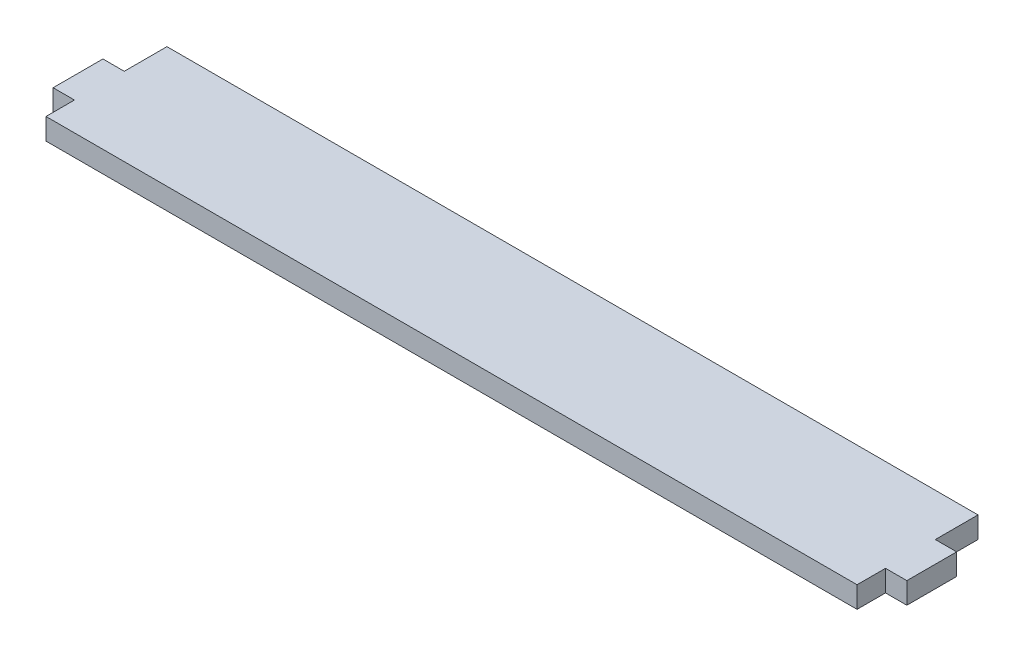
ISO-10303-21;
HEADER;
FILE_DESCRIPTION(('STEP AP214'),'2;1');
FILE_NAME('part.step','',(''),(''),'','','');
FILE_SCHEMA(('AUTOMOTIVE_DESIGN { 1 0 10303 214 1 1 1 1 }'));
ENDSEC;
DATA;
#1=APPLICATION_CONTEXT('core data for automotive mechanical design processes');
#2=APPLICATION_PROTOCOL_DEFINITION('international standard','automotive_design',2000,#1);
#3=PRODUCT_CONTEXT('',#1,'mechanical');
#4=PRODUCT('Part','Part','',(#3));
#5=PRODUCT_RELATED_PRODUCT_CATEGORY('part','',(#4));
#6=PRODUCT_DEFINITION_FORMATION('','',#4);
#7=PRODUCT_DEFINITION_CONTEXT('part definition',#1,'design');
#8=PRODUCT_DEFINITION('design','',#6,#7);
#9=PRODUCT_DEFINITION_SHAPE('','',#8);
#10=(LENGTH_UNIT() NAMED_UNIT(*) SI_UNIT(.MILLI.,.METRE.));
#11=(NAMED_UNIT(*) PLANE_ANGLE_UNIT() SI_UNIT($,.RADIAN.));
#12=(NAMED_UNIT(*) SI_UNIT($,.STERADIAN.) SOLID_ANGLE_UNIT());
#13=UNCERTAINTY_MEASURE_WITH_UNIT(LENGTH_MEASURE(1.E-05),#10,'distance_accuracy_value','');
#14=(GEOMETRIC_REPRESENTATION_CONTEXT(3) GLOBAL_UNCERTAINTY_ASSIGNED_CONTEXT((#13)) GLOBAL_UNIT_ASSIGNED_CONTEXT((#10,
#11,#12)) REPRESENTATION_CONTEXT('',''));
#15=CARTESIAN_POINT('',(0.,0.,0.));
#16=DIRECTION('',(0.,0.,1.));
#17=DIRECTION('',(1.,0.,0.));
#18=AXIS2_PLACEMENT_3D('',#15,#16,#17);
#19=CARTESIAN_POINT('',(-57.,3.,-2.5));
#20=DIRECTION('',(1.,0.,0.));
#21=DIRECTION('',(0.,0.,-1.));
#22=AXIS2_PLACEMENT_3D('',#19,#20,#21);
#23=PLANE('',#22);
#24=DIRECTION('',(0.,0.,1.));
#25=VECTOR('',#24,1.);
#26=CARTESIAN_POINT('',(-57.,0.,-2.5));
#27=LINE('',#26,#25);
#28=CARTESIAN_POINT('',(-57.,0.,-8.49999999999999));
#29=VERTEX_POINT('',#28);
#30=CARTESIAN_POINT('',(-57.,0.,-2.5));
#31=VERTEX_POINT('',#30);
#32=EDGE_CURVE('E155',#29,#31,#27,.T.);
#33=ORIENTED_EDGE('',*,*,#32,.T.);
#34=DIRECTION('',(0.,-1.,0.));
#35=VECTOR('',#34,1.);
#36=CARTESIAN_POINT('',(-57.,3.,-2.5));
#37=LINE('',#36,#35);
#38=CARTESIAN_POINT('',(-57.,3.,-2.5));
#39=VERTEX_POINT('',#38);
#40=EDGE_CURVE('E11',#39,#31,#37,.T.);
#41=ORIENTED_EDGE('',*,*,#40,.F.);
#42=DIRECTION('',(0.,0.,1.));
#43=VECTOR('',#42,1.);
#44=CARTESIAN_POINT('',(-57.,3.,-2.5));
#45=LINE('',#44,#43);
#46=CARTESIAN_POINT('',(-57.,3.,-8.49999999999999));
#47=VERTEX_POINT('',#46);
#48=EDGE_CURVE('E177',#47,#39,#45,.T.);
#49=ORIENTED_EDGE('',*,*,#48,.F.);
#50=DIRECTION('',(0.,-1.,0.));
#51=VECTOR('',#50,1.);
#52=CARTESIAN_POINT('',(-57.,3.,-8.49999999999999));
#53=LINE('',#52,#51);
#54=EDGE_CURVE('E151',#47,#29,#53,.T.);
#55=ORIENTED_EDGE('',*,*,#54,.T.);
#56=EDGE_LOOP('',(#33,#41,#49,#55));
#57=FACE_BOUND('',#56,.T.);
#58=ADVANCED_FACE('F35',(#57),#23,.F.);
#59=CARTESIAN_POINT('',(-57.,3.,-2.5));
#60=DIRECTION('',(0.,0.,1.));
#61=DIRECTION('',(1.,0.,0.));
#62=AXIS2_PLACEMENT_3D('',#59,#60,#61);
#63=PLANE('',#62);
#64=DIRECTION('',(-1.,0.,0.));
#65=VECTOR('',#64,1.);
#66=CARTESIAN_POINT('',(-57.,0.,-2.5));
#67=LINE('',#66,#65);
#68=CARTESIAN_POINT('',(-60.,0.,-2.5));
#69=VERTEX_POINT('',#68);
#70=EDGE_CURVE('E158',#31,#69,#67,.T.);
#71=ORIENTED_EDGE('',*,*,#70,.T.);
#72=DIRECTION('',(0.,-1.,0.));
#73=VECTOR('',#72,1.);
#74=CARTESIAN_POINT('',(-60.,3.,-2.5));
#75=LINE('',#74,#73);
#76=CARTESIAN_POINT('',(-60.,3.,-2.5));
#77=VERTEX_POINT('',#76);
#78=EDGE_CURVE('E43',#77,#69,#75,.T.);
#79=ORIENTED_EDGE('',*,*,#78,.F.);
#80=DIRECTION('',(-1.,0.,0.));
#81=VECTOR('',#80,1.);
#82=CARTESIAN_POINT('',(-57.,3.,-2.5));
#83=LINE('',#82,#81);
#84=EDGE_CURVE('E106',#39,#77,#83,.T.);
#85=ORIENTED_EDGE('',*,*,#84,.F.);
#86=ORIENTED_EDGE('',*,*,#40,.T.);
#87=EDGE_LOOP('',(#71,#79,#85,#86));
#88=FACE_BOUND('',#87,.T.);
#89=ADVANCED_FACE('F255',(#88),#63,.F.);
#90=CARTESIAN_POINT('',(-60.,3.,-2.5));
#91=DIRECTION('',(1.,0.,0.));
#92=DIRECTION('',(0.,0.,-1.));
#93=AXIS2_PLACEMENT_3D('',#90,#91,#92);
#94=PLANE('',#93);
#95=DIRECTION('',(0.,0.,1.));
#96=VECTOR('',#95,1.);
#97=CARTESIAN_POINT('',(-60.,0.,-2.5));
#98=LINE('',#97,#96);
#99=CARTESIAN_POINT('',(-60.,0.,4.5));
#100=VERTEX_POINT('',#99);
#101=EDGE_CURVE('E160',#69,#100,#98,.T.);
#102=ORIENTED_EDGE('',*,*,#101,.T.);
#103=DIRECTION('',(0.,-1.,0.));
#104=VECTOR('',#103,1.);
#105=CARTESIAN_POINT('',(-60.,3.,4.5));
#106=LINE('',#105,#104);
#107=CARTESIAN_POINT('',(-60.,3.,4.5));
#108=VERTEX_POINT('',#107);
#109=EDGE_CURVE('E196',#108,#100,#106,.T.);
#110=ORIENTED_EDGE('',*,*,#109,.F.);
#111=DIRECTION('',(0.,0.,1.));
#112=VECTOR('',#111,1.);
#113=CARTESIAN_POINT('',(-60.,3.,-2.5));
#114=LINE('',#113,#112);
#115=EDGE_CURVE('E204',#77,#108,#114,.T.);
#116=ORIENTED_EDGE('',*,*,#115,.F.);
#117=ORIENTED_EDGE('',*,*,#78,.T.);
#118=EDGE_LOOP('',(#102,#110,#116,#117));
#119=FACE_BOUND('',#118,.T.);
#120=ADVANCED_FACE('F202',(#119),#94,.F.);
#121=CARTESIAN_POINT('',(-60.,3.,4.5));
#122=DIRECTION('',(0.,0.,-1.));
#123=DIRECTION('',(-1.,0.,0.));
#124=AXIS2_PLACEMENT_3D('',#121,#122,#123);
#125=PLANE('',#124);
#126=DIRECTION('',(1.,0.,0.));
#127=VECTOR('',#126,1.);
#128=CARTESIAN_POINT('',(-60.,0.,4.5));
#129=LINE('',#128,#127);
#130=CARTESIAN_POINT('',(-57.,0.,4.5));
#131=VERTEX_POINT('',#130);
#132=EDGE_CURVE('E162',#100,#131,#129,.T.);
#133=ORIENTED_EDGE('',*,*,#132,.T.);
#134=DIRECTION('',(0.,-1.,0.));
#135=VECTOR('',#134,1.);
#136=CARTESIAN_POINT('',(-57.,3.,4.5));
#137=LINE('',#136,#135);
#138=CARTESIAN_POINT('',(-57.,3.,4.5));
#139=VERTEX_POINT('',#138);
#140=EDGE_CURVE('E193',#139,#131,#137,.T.);
#141=ORIENTED_EDGE('',*,*,#140,.F.);
#142=DIRECTION('',(1.,0.,0.));
#143=VECTOR('',#142,1.);
#144=CARTESIAN_POINT('',(-60.,3.,4.5));
#145=LINE('',#144,#143);
#146=EDGE_CURVE('E222',#108,#139,#145,.T.);
#147=ORIENTED_EDGE('',*,*,#146,.F.);
#148=ORIENTED_EDGE('',*,*,#109,.T.);
#149=EDGE_LOOP('',(#133,#141,#147,#148));
#150=FACE_BOUND('',#149,.T.);
#151=ADVANCED_FACE('F213',(#150),#125,.F.);
#152=CARTESIAN_POINT('',(-57.,3.,8.50000000000001));
#153=DIRECTION('',(1.,0.,0.));
#154=DIRECTION('',(0.,0.,-1.));
#155=AXIS2_PLACEMENT_3D('',#152,#153,#154);
#156=PLANE('',#155);
#157=DIRECTION('',(0.,0.,1.));
#158=VECTOR('',#157,1.);
#159=CARTESIAN_POINT('',(-57.,0.,8.50000000000001));
#160=LINE('',#159,#158);
#161=CARTESIAN_POINT('',(-57.,0.,8.50000000000001));
#162=VERTEX_POINT('',#161);
#163=EDGE_CURVE('E164',#131,#162,#160,.T.);
#164=ORIENTED_EDGE('',*,*,#163,.T.);
#165=DIRECTION('',(0.,-1.,0.));
#166=VECTOR('',#165,1.);
#167=CARTESIAN_POINT('',(-57.,3.,8.50000000000001));
#168=LINE('',#167,#166);
#169=CARTESIAN_POINT('',(-57.,3.,8.50000000000001));
#170=VERTEX_POINT('',#169);
#171=EDGE_CURVE('E190',#170,#162,#168,.T.);
#172=ORIENTED_EDGE('',*,*,#171,.F.);
#173=DIRECTION('',(0.,0.,1.));
#174=VECTOR('',#173,1.);
#175=CARTESIAN_POINT('',(-57.,3.,8.50000000000001));
#176=LINE('',#175,#174);
#177=EDGE_CURVE('E219',#139,#170,#176,.T.);
#178=ORIENTED_EDGE('',*,*,#177,.F.);
#179=ORIENTED_EDGE('',*,*,#140,.T.);
#180=EDGE_LOOP('',(#164,#172,#178,#179));
#181=FACE_BOUND('',#180,.T.);
#182=ADVANCED_FACE('F217',(#181),#156,.F.);
#183=CARTESIAN_POINT('',(57.,3.,8.49999999999999));
#184=DIRECTION('',(0.,0.,-1.));
#185=DIRECTION('',(-1.,0.,0.));
#186=AXIS2_PLACEMENT_3D('',#183,#184,#185);
#187=PLANE('',#186);
#188=DIRECTION('',(1.,0.,0.));
#189=VECTOR('',#188,1.);
#190=CARTESIAN_POINT('',(57.,0.,8.49999999999999));
#191=LINE('',#190,#189);
#192=CARTESIAN_POINT('',(57.,0.,8.49999999999999));
#193=VERTEX_POINT('',#192);
#194=EDGE_CURVE('E166',#162,#193,#191,.T.);
#195=ORIENTED_EDGE('',*,*,#194,.T.);
#196=DIRECTION('',(0.,-1.,0.));
#197=VECTOR('',#196,1.);
#198=CARTESIAN_POINT('',(57.,3.,8.49999999999999));
#199=LINE('',#198,#197);
#200=CARTESIAN_POINT('',(57.,3.,8.49999999999999));
#201=VERTEX_POINT('',#200);
#202=EDGE_CURVE('E187',#201,#193,#199,.T.);
#203=ORIENTED_EDGE('',*,*,#202,.F.);
#204=DIRECTION('',(1.,0.,0.));
#205=VECTOR('',#204,1.);
#206=CARTESIAN_POINT('',(57.,3.,8.49999999999999));
#207=LINE('',#206,#205);
#208=EDGE_CURVE('E221',#170,#201,#207,.T.);
#209=ORIENTED_EDGE('',*,*,#208,.F.);
#210=ORIENTED_EDGE('',*,*,#171,.T.);
#211=EDGE_LOOP('',(#195,#203,#209,#210));
#212=FACE_BOUND('',#211,.T.);
#213=ADVANCED_FACE('F268',(#212),#187,.F.);
#214=CARTESIAN_POINT('',(57.,3.,8.49999999999999));
#215=DIRECTION('',(-1.,0.,0.));
#216=DIRECTION('',(0.,0.,1.));
#217=AXIS2_PLACEMENT_3D('',#214,#215,#216);
#218=PLANE('',#217);
#219=DIRECTION('',(0.,0.,-1.));
#220=VECTOR('',#219,1.);
#221=CARTESIAN_POINT('',(57.,0.,8.49999999999999));
#222=LINE('',#221,#220);
#223=CARTESIAN_POINT('',(57.,0.,4.49999999999999));
#224=VERTEX_POINT('',#223);
#225=EDGE_CURVE('E168',#193,#224,#222,.T.);
#226=ORIENTED_EDGE('',*,*,#225,.T.);
#227=DIRECTION('',(0.,-1.,0.));
#228=VECTOR('',#227,1.);
#229=CARTESIAN_POINT('',(57.,3.,4.49999999999999));
#230=LINE('',#229,#228);
#231=CARTESIAN_POINT('',(57.,3.,4.49999999999999));
#232=VERTEX_POINT('',#231);
#233=EDGE_CURVE('E184',#232,#224,#230,.T.);
#234=ORIENTED_EDGE('',*,*,#233,.F.);
#235=DIRECTION('',(0.,0.,-1.));
#236=VECTOR('',#235,1.);
#237=CARTESIAN_POINT('',(57.,3.,8.49999999999999));
#238=LINE('',#237,#236);
#239=EDGE_CURVE('E224',#201,#232,#238,.T.);
#240=ORIENTED_EDGE('',*,*,#239,.F.);
#241=ORIENTED_EDGE('',*,*,#202,.T.);
#242=EDGE_LOOP('',(#226,#234,#240,#241));
#243=FACE_BOUND('',#242,.T.);
#244=ADVANCED_FACE('F271',(#243),#218,.F.);
#245=CARTESIAN_POINT('',(60.,3.,4.49999999999999));
#246=DIRECTION('',(0.,0.,-1.));
#247=DIRECTION('',(-1.,0.,0.));
#248=AXIS2_PLACEMENT_3D('',#245,#246,#247);
#249=PLANE('',#248);
#250=DIRECTION('',(1.,0.,0.));
#251=VECTOR('',#250,1.);
#252=CARTESIAN_POINT('',(60.,0.,4.49999999999999));
#253=LINE('',#252,#251);
#254=CARTESIAN_POINT('',(60.,0.,4.49999999999999));
#255=VERTEX_POINT('',#254);
#256=EDGE_CURVE('E170',#224,#255,#253,.T.);
#257=ORIENTED_EDGE('',*,*,#256,.T.);
#258=DIRECTION('',(0.,-1.,0.));
#259=VECTOR('',#258,1.);
#260=CARTESIAN_POINT('',(60.,3.,4.49999999999999));
#261=LINE('',#260,#259);
#262=CARTESIAN_POINT('',(60.,3.,4.49999999999999));
#263=VERTEX_POINT('',#262);
#264=EDGE_CURVE('E181',#263,#255,#261,.T.);
#265=ORIENTED_EDGE('',*,*,#264,.F.);
#266=DIRECTION('',(1.,0.,0.));
#267=VECTOR('',#266,1.);
#268=CARTESIAN_POINT('',(60.,3.,4.49999999999999));
#269=LINE('',#268,#267);
#270=EDGE_CURVE('E230',#232,#263,#269,.T.);
#271=ORIENTED_EDGE('',*,*,#270,.F.);
#272=ORIENTED_EDGE('',*,*,#233,.T.);
#273=EDGE_LOOP('',(#257,#265,#271,#272));
#274=FACE_BOUND('',#273,.T.);
#275=ADVANCED_FACE('F236',(#274),#249,.F.);
#276=CARTESIAN_POINT('',(60.,3.,-2.50000000000001));
#277=DIRECTION('',(-1.,0.,0.));
#278=DIRECTION('',(0.,0.,1.));
#279=AXIS2_PLACEMENT_3D('',#276,#277,#278);
#280=PLANE('',#279);
#281=DIRECTION('',(0.,0.,-1.));
#282=VECTOR('',#281,1.);
#283=CARTESIAN_POINT('',(60.,0.,-2.50000000000001));
#284=LINE('',#283,#282);
#285=CARTESIAN_POINT('',(60.,0.,-2.50000000000001));
#286=VERTEX_POINT('',#285);
#287=EDGE_CURVE('E172',#255,#286,#284,.T.);
#288=ORIENTED_EDGE('',*,*,#287,.T.);
#289=DIRECTION('',(0.,-1.,0.));
#290=VECTOR('',#289,1.);
#291=CARTESIAN_POINT('',(60.,3.,-2.50000000000001));
#292=LINE('',#291,#290);
#293=CARTESIAN_POINT('',(60.,3.,-2.50000000000001));
#294=VERTEX_POINT('',#293);
#295=EDGE_CURVE('E146',#294,#286,#292,.T.);
#296=ORIENTED_EDGE('',*,*,#295,.F.);
#297=DIRECTION('',(0.,0.,-1.));
#298=VECTOR('',#297,1.);
#299=CARTESIAN_POINT('',(60.,3.,-2.50000000000001));
#300=LINE('',#299,#298);
#301=EDGE_CURVE('E137',#263,#294,#300,.T.);
#302=ORIENTED_EDGE('',*,*,#301,.F.);
#303=ORIENTED_EDGE('',*,*,#264,.T.);
#304=EDGE_LOOP('',(#288,#296,#302,#303));
#305=FACE_BOUND('',#304,.T.);
#306=ADVANCED_FACE('F240',(#305),#280,.F.);
#307=CARTESIAN_POINT('',(57.,3.,-2.50000000000001));
#308=DIRECTION('',(0.,0.,1.));
#309=DIRECTION('',(1.,0.,0.));
#310=AXIS2_PLACEMENT_3D('',#307,#308,#309);
#311=PLANE('',#310);
#312=DIRECTION('',(-1.,0.,0.));
#313=VECTOR('',#312,1.);
#314=CARTESIAN_POINT('',(57.,0.,-2.50000000000001));
#315=LINE('',#314,#313);
#316=CARTESIAN_POINT('',(57.,0.,-2.50000000000001));
#317=VERTEX_POINT('',#316);
#318=EDGE_CURVE('E145',#286,#317,#315,.T.);
#319=ORIENTED_EDGE('',*,*,#318,.T.);
#320=DIRECTION('',(0.,-1.,0.));
#321=VECTOR('',#320,1.);
#322=CARTESIAN_POINT('',(57.,3.,-2.50000000000001));
#323=LINE('',#322,#321);
#324=CARTESIAN_POINT('',(57.,3.,-2.50000000000001));
#325=VERTEX_POINT('',#324);
#326=EDGE_CURVE('E142',#325,#317,#323,.T.);
#327=ORIENTED_EDGE('',*,*,#326,.F.);
#328=DIRECTION('',(-1.,0.,0.));
#329=VECTOR('',#328,1.);
#330=CARTESIAN_POINT('',(57.,3.,-2.50000000000001));
#331=LINE('',#330,#329);
#332=EDGE_CURVE('E131',#294,#325,#331,.T.);
#333=ORIENTED_EDGE('',*,*,#332,.F.);
#334=ORIENTED_EDGE('',*,*,#295,.T.);
#335=EDGE_LOOP('',(#319,#327,#333,#334));
#336=FACE_BOUND('',#335,.T.);
#337=ADVANCED_FACE('F143',(#336),#311,.F.);
#338=CARTESIAN_POINT('',(57.,3.,-2.50000000000001));
#339=DIRECTION('',(-1.,0.,0.));
#340=DIRECTION('',(0.,0.,1.));
#341=AXIS2_PLACEMENT_3D('',#338,#339,#340);
#342=PLANE('',#341);
#343=DIRECTION('',(0.,0.,-1.));
#344=VECTOR('',#343,1.);
#345=CARTESIAN_POINT('',(57.,0.,-2.50000000000001));
#346=LINE('',#345,#344);
#347=CARTESIAN_POINT('',(57.,0.,-8.50000000000001));
#348=VERTEX_POINT('',#347);
#349=EDGE_CURVE('E92',#317,#348,#346,.T.);
#350=ORIENTED_EDGE('',*,*,#349,.T.);
#351=DIRECTION('',(0.,-1.,0.));
#352=VECTOR('',#351,1.);
#353=CARTESIAN_POINT('',(57.,3.,-8.50000000000001));
#354=LINE('',#353,#352);
#355=CARTESIAN_POINT('',(57.,3.,-8.50000000000001));
#356=VERTEX_POINT('',#355);
#357=EDGE_CURVE('E147',#356,#348,#354,.T.);
#358=ORIENTED_EDGE('',*,*,#357,.F.);
#359=DIRECTION('',(0.,0.,-1.));
#360=VECTOR('',#359,1.);
#361=CARTESIAN_POINT('',(57.,3.,-2.50000000000001));
#362=LINE('',#361,#360);
#363=EDGE_CURVE('E135',#325,#356,#362,.T.);
#364=ORIENTED_EDGE('',*,*,#363,.F.);
#365=ORIENTED_EDGE('',*,*,#326,.T.);
#366=EDGE_LOOP('',(#350,#358,#364,#365));
#367=FACE_BOUND('',#366,.T.);
#368=ADVANCED_FACE('F149',(#367),#342,.F.);
#369=CARTESIAN_POINT('',(57.,3.,-8.50000000000001));
#370=DIRECTION('',(0.,0.,1.));
#371=DIRECTION('',(1.,0.,0.));
#372=AXIS2_PLACEMENT_3D('',#369,#370,#371);
#373=PLANE('',#372);
#374=DIRECTION('',(-1.,0.,0.));
#375=VECTOR('',#374,1.);
#376=CARTESIAN_POINT('',(57.,0.,-8.50000000000001));
#377=LINE('',#376,#375);
#378=EDGE_CURVE('E98',#348,#29,#377,.T.);
#379=ORIENTED_EDGE('',*,*,#378,.T.);
#380=ORIENTED_EDGE('',*,*,#54,.F.);
#381=DIRECTION('',(-1.,0.,0.));
#382=VECTOR('',#381,1.);
#383=CARTESIAN_POINT('',(57.,3.,-8.50000000000001));
#384=LINE('',#383,#382);
#385=EDGE_CURVE('E51',#356,#47,#384,.T.);
#386=ORIENTED_EDGE('',*,*,#385,.F.);
#387=ORIENTED_EDGE('',*,*,#357,.T.);
#388=EDGE_LOOP('',(#379,#380,#386,#387));
#389=FACE_BOUND('',#388,.T.);
#390=ADVANCED_FACE('F244',(#389),#373,.F.);
#391=CARTESIAN_POINT('',(0.,3.,0.));
#392=DIRECTION('',(0.,1.,0.));
#393=DIRECTION('',(0.,0.,1.));
#394=AXIS2_PLACEMENT_3D('',#391,#392,#393);
#395=PLANE('',#394);
#396=ORIENTED_EDGE('',*,*,#48,.T.);
#397=ORIENTED_EDGE('',*,*,#84,.T.);
#398=ORIENTED_EDGE('',*,*,#115,.T.);
#399=ORIENTED_EDGE('',*,*,#146,.T.);
#400=ORIENTED_EDGE('',*,*,#177,.T.);
#401=ORIENTED_EDGE('',*,*,#208,.T.);
#402=ORIENTED_EDGE('',*,*,#239,.T.);
#403=ORIENTED_EDGE('',*,*,#270,.T.);
#404=ORIENTED_EDGE('',*,*,#301,.T.);
#405=ORIENTED_EDGE('',*,*,#332,.T.);
#406=ORIENTED_EDGE('',*,*,#363,.T.);
#407=ORIENTED_EDGE('',*,*,#385,.T.);
#408=EDGE_LOOP('',(#396,#397,#398,#399,#400,#401,#402,#403,#404,#405,#406,#407));
#409=FACE_BOUND('',#408,.T.);
#410=ADVANCED_FACE('F133',(#409),#395,.T.);
#411=CARTESIAN_POINT('',(0.,0.,0.));
#412=DIRECTION('',(0.,1.,0.));
#413=DIRECTION('',(0.,0.,1.));
#414=AXIS2_PLACEMENT_3D('',#411,#412,#413);
#415=PLANE('',#414);
#416=ORIENTED_EDGE('',*,*,#32,.F.);
#417=ORIENTED_EDGE('',*,*,#378,.F.);
#418=ORIENTED_EDGE('',*,*,#349,.F.);
#419=ORIENTED_EDGE('',*,*,#318,.F.);
#420=ORIENTED_EDGE('',*,*,#287,.F.);
#421=ORIENTED_EDGE('',*,*,#256,.F.);
#422=ORIENTED_EDGE('',*,*,#225,.F.);
#423=ORIENTED_EDGE('',*,*,#194,.F.);
#424=ORIENTED_EDGE('',*,*,#163,.F.);
#425=ORIENTED_EDGE('',*,*,#132,.F.);
#426=ORIENTED_EDGE('',*,*,#101,.F.);
#427=ORIENTED_EDGE('',*,*,#70,.F.);
#428=EDGE_LOOP('',(#416,#417,#418,#419,#420,#421,#422,#423,#424,#425,#426,#427));
#429=FACE_BOUND('',#428,.T.);
#430=ADVANCED_FACE('F208',(#429),#415,.F.);
#431=CLOSED_SHELL('',(#58,#89,#120,#151,#182,#213,#244,#275,#306,#337,#368,#390,#410,#430));
#432=MANIFOLD_SOLID_BREP('B2',#431);
#433=ADVANCED_BREP_SHAPE_REPRESENTATION('',(#18,#432),#14);
#434=SHAPE_DEFINITION_REPRESENTATION(#9,#433);
ENDSEC;
END-ISO-10303-21;
